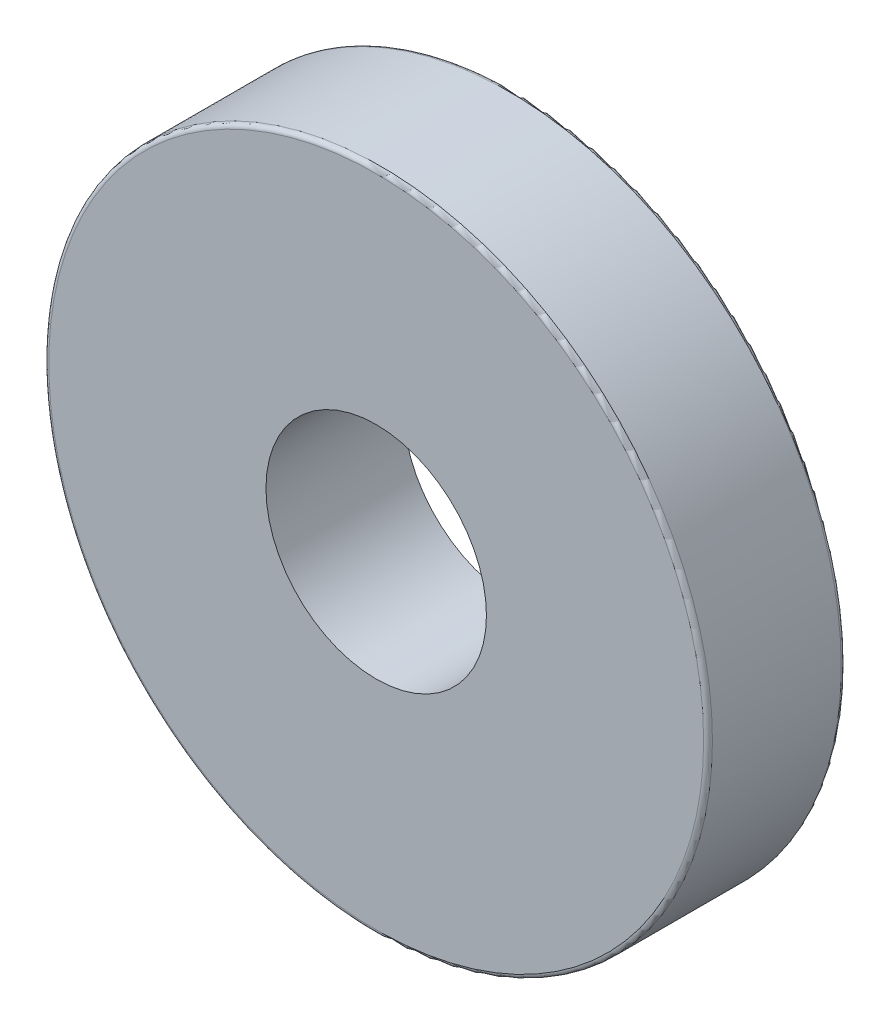
ISO-10303-21;
HEADER;
FILE_DESCRIPTION(('STEP AP214'),'2;1');
FILE_NAME('part.step','',(''),(''),'','','');
FILE_SCHEMA(('AUTOMOTIVE_DESIGN { 1 0 10303 214 1 1 1 1 }'));
ENDSEC;
DATA;
#1=APPLICATION_CONTEXT('core data for automotive mechanical design processes');
#2=APPLICATION_PROTOCOL_DEFINITION('international standard','automotive_design',2000,#1);
#3=PRODUCT_CONTEXT('',#1,'mechanical');
#4=PRODUCT('Part','Part','',(#3));
#5=PRODUCT_RELATED_PRODUCT_CATEGORY('part','',(#4));
#6=PRODUCT_DEFINITION_FORMATION('','',#4);
#7=PRODUCT_DEFINITION_CONTEXT('part definition',#1,'design');
#8=PRODUCT_DEFINITION('design','',#6,#7);
#9=PRODUCT_DEFINITION_SHAPE('','',#8);
#10=(LENGTH_UNIT() NAMED_UNIT(*) SI_UNIT(.MILLI.,.METRE.));
#11=(NAMED_UNIT(*) PLANE_ANGLE_UNIT() SI_UNIT($,.RADIAN.));
#12=(NAMED_UNIT(*) SI_UNIT($,.STERADIAN.) SOLID_ANGLE_UNIT());
#13=UNCERTAINTY_MEASURE_WITH_UNIT(LENGTH_MEASURE(1.E-05),#10,'distance_accuracy_value','');
#14=(GEOMETRIC_REPRESENTATION_CONTEXT(3) GLOBAL_UNCERTAINTY_ASSIGNED_CONTEXT((#13)) GLOBAL_UNIT_ASSIGNED_CONTEXT((#10,
#11,#12)) REPRESENTATION_CONTEXT('',''));
#15=CARTESIAN_POINT('',(0.,0.,0.));
#16=DIRECTION('',(0.,0.,1.));
#17=DIRECTION('',(1.,0.,0.));
#18=AXIS2_PLACEMENT_3D('',#15,#16,#17);
#19=CARTESIAN_POINT('',(-3.6195,0.,-5.9436));
#20=DIRECTION('',(0.,0.,1.));
#21=DIRECTION('',(1.,0.,0.));
#22=AXIS2_PLACEMENT_3D('',#19,#20,#21);
#23=CYLINDRICAL_SURFACE('',#22,4.7625);
#24=CARTESIAN_POINT('',(-3.6195,0.,0.));
#25=DIRECTION('',(0.,0.,1.));
#26=DIRECTION('',(1.,0.,0.));
#27=AXIS2_PLACEMENT_3D('',#24,#25,#26);
#28=CIRCLE('',#27,4.7625);
#29=CARTESIAN_POINT('',(1.143,0.,0.));
#30=VERTEX_POINT('',#29);
#31=EDGE_CURVE('E10',#30,#30,#28,.T.);
#32=ORIENTED_EDGE('',*,*,#31,.T.);
#33=EDGE_LOOP('',(#32));
#34=FACE_BOUND('',#33,.T.);
#35=CARTESIAN_POINT('',(-3.6195,0.,-5.9436));
#36=DIRECTION('',(0.,0.,1.));
#37=DIRECTION('',(1.,0.,0.));
#38=AXIS2_PLACEMENT_3D('',#35,#36,#37);
#39=CIRCLE('',#38,4.7625);
#40=CARTESIAN_POINT('',(1.143,0.,-5.9436));
#41=VERTEX_POINT('',#40);
#42=EDGE_CURVE('E68',#41,#41,#39,.T.);
#43=ORIENTED_EDGE('',*,*,#42,.F.);
#44=EDGE_LOOP('',(#43));
#45=FACE_BOUND('',#44,.T.);
#46=ADVANCED_FACE('F41',(#34,#45),#23,.F.);
#47=CARTESIAN_POINT('',(1.143,0.,0.));
#48=DIRECTION('',(0.,0.,1.));
#49=DIRECTION('',(1.,0.,0.));
#50=AXIS2_PLACEMENT_3D('',#47,#48,#49);
#51=PLANE('',#50);
#52=CARTESIAN_POINT('',(-3.6195,0.,0.));
#53=DIRECTION('',(0.,0.,1.));
#54=DIRECTION('',(1.,0.,0.));
#55=AXIS2_PLACEMENT_3D('',#52,#53,#54);
#56=CIRCLE('',#55,14.144625);
#57=CARTESIAN_POINT('',(10.525125,0.,0.));
#58=VERTEX_POINT('',#57);
#59=EDGE_CURVE('E48',#58,#58,#56,.T.);
#60=ORIENTED_EDGE('',*,*,#59,.T.);
#61=EDGE_LOOP('',(#60));
#62=FACE_BOUND('',#61,.T.);
#63=ORIENTED_EDGE('',*,*,#31,.F.);
#64=EDGE_LOOP('',(#63));
#65=FACE_BOUND('',#64,.T.);
#66=ADVANCED_FACE('F77',(#62,#65),#51,.T.);
#67=CARTESIAN_POINT('',(-3.6195,0.,-0.190499999999998));
#68=DIRECTION('',(0.,0.,1.));
#69=DIRECTION('',(1.,0.,0.));
#70=AXIS2_PLACEMENT_3D('',#67,#68,#69);
#71=TOROIDAL_SURFACE('',#70,14.144625,0.1905);
#72=CARTESIAN_POINT('',(-3.6195,0.,-0.190499999999998));
#73=DIRECTION('',(0.,0.,1.));
#74=DIRECTION('',(1.,0.,0.));
#75=AXIS2_PLACEMENT_3D('',#72,#73,#74);
#76=CIRCLE('',#75,14.335125);
#77=CARTESIAN_POINT('',(10.715625,0.,-0.1905));
#78=VERTEX_POINT('',#77);
#79=EDGE_CURVE('E53',#78,#78,#76,.T.);
#80=ORIENTED_EDGE('',*,*,#79,.T.);
#81=EDGE_LOOP('',(#80));
#82=FACE_BOUND('',#81,.T.);
#83=ORIENTED_EDGE('',*,*,#59,.F.);
#84=EDGE_LOOP('',(#83));
#85=FACE_BOUND('',#84,.T.);
#86=ADVANCED_FACE('F81',(#82,#85),#71,.T.);
#87=CARTESIAN_POINT('',(-3.6195,0.,-5.9436));
#88=DIRECTION('',(0.,0.,1.));
#89=DIRECTION('',(1.,0.,0.));
#90=AXIS2_PLACEMENT_3D('',#87,#88,#89);
#91=CYLINDRICAL_SURFACE('',#90,14.335125);
#92=CARTESIAN_POINT('',(-3.6195,0.,-5.7531));
#93=DIRECTION('',(0.,0.,1.));
#94=DIRECTION('',(1.,0.,0.));
#95=AXIS2_PLACEMENT_3D('',#92,#93,#94);
#96=CIRCLE('',#95,14.335125);
#97=CARTESIAN_POINT('',(10.715625,0.,-5.7531));
#98=VERTEX_POINT('',#97);
#99=EDGE_CURVE('E58',#98,#98,#96,.T.);
#100=ORIENTED_EDGE('',*,*,#99,.T.);
#101=EDGE_LOOP('',(#100));
#102=FACE_BOUND('',#101,.T.);
#103=ORIENTED_EDGE('',*,*,#79,.F.);
#104=EDGE_LOOP('',(#103));
#105=FACE_BOUND('',#104,.T.);
#106=ADVANCED_FACE('F85',(#102,#105),#91,.T.);
#107=CARTESIAN_POINT('',(-3.6195,0.,-5.7531));
#108=DIRECTION('',(0.,0.,1.));
#109=DIRECTION('',(1.,0.,0.));
#110=AXIS2_PLACEMENT_3D('',#107,#108,#109);
#111=TOROIDAL_SURFACE('',#110,14.144625,0.190500000000001);
#112=CARTESIAN_POINT('',(-3.6195,0.,-5.9436));
#113=DIRECTION('',(0.,0.,1.));
#114=DIRECTION('',(1.,0.,0.));
#115=AXIS2_PLACEMENT_3D('',#112,#113,#114);
#116=CIRCLE('',#115,14.144625);
#117=CARTESIAN_POINT('',(10.525125,0.,-5.9436));
#118=VERTEX_POINT('',#117);
#119=EDGE_CURVE('E64',#118,#118,#116,.T.);
#120=ORIENTED_EDGE('',*,*,#119,.T.);
#121=EDGE_LOOP('',(#120));
#122=FACE_BOUND('',#121,.T.);
#123=ORIENTED_EDGE('',*,*,#99,.F.);
#124=EDGE_LOOP('',(#123));
#125=FACE_BOUND('',#124,.T.);
#126=ADVANCED_FACE('F92',(#122,#125),#111,.T.);
#127=CARTESIAN_POINT('',(10.525125,0.,-5.9436));
#128=DIRECTION('',(0.,0.,-1.));
#129=DIRECTION('',(-1.,0.,0.));
#130=AXIS2_PLACEMENT_3D('',#127,#128,#129);
#131=PLANE('',#130);
#132=ORIENTED_EDGE('',*,*,#42,.T.);
#133=EDGE_LOOP('',(#132));
#134=FACE_BOUND('',#133,.T.);
#135=ORIENTED_EDGE('',*,*,#119,.F.);
#136=EDGE_LOOP('',(#135));
#137=FACE_BOUND('',#136,.T.);
#138=ADVANCED_FACE('F73',(#134,#137),#131,.T.);
#139=CLOSED_SHELL('',(#46,#66,#86,#106,#126,#138));
#140=MANIFOLD_SOLID_BREP('B2',#139);
#141=ADVANCED_BREP_SHAPE_REPRESENTATION('',(#18,#140),#14);
#142=SHAPE_DEFINITION_REPRESENTATION(#9,#141);
ENDSEC;
END-ISO-10303-21;
